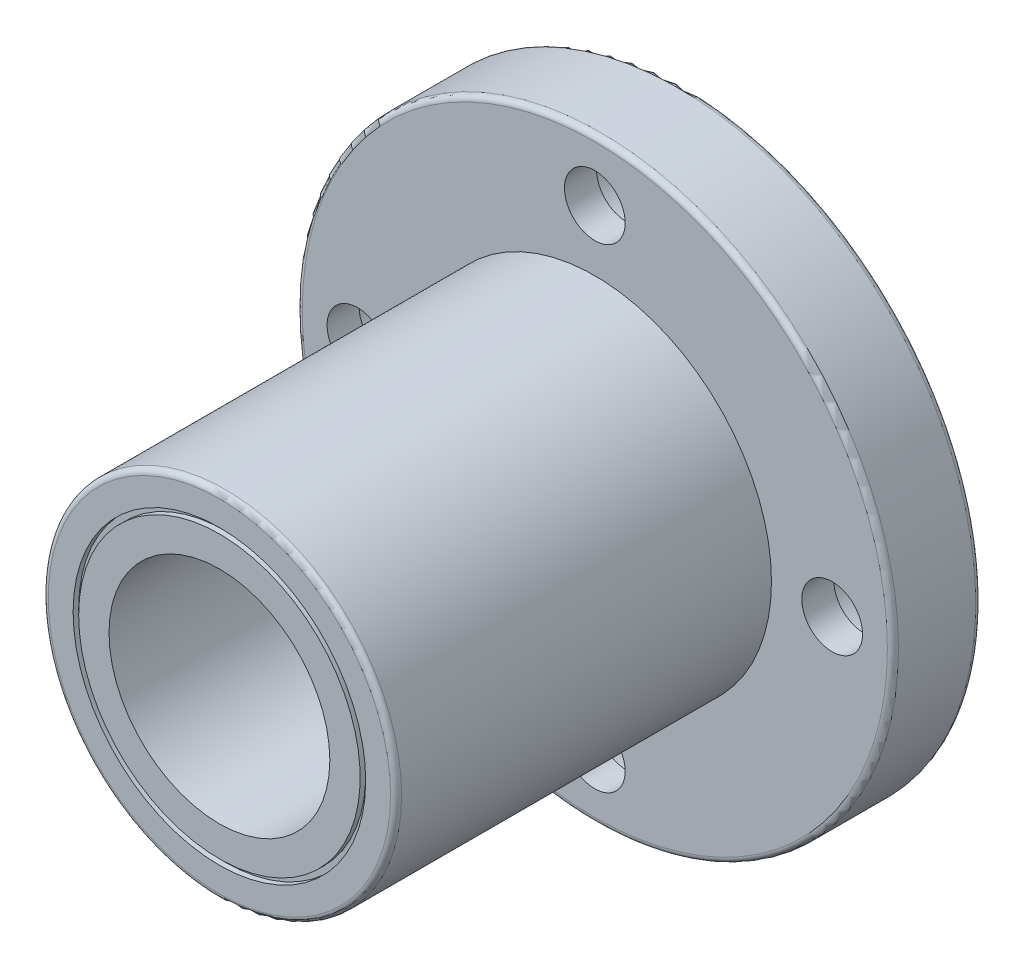
ISO-10303-21;
HEADER;
FILE_DESCRIPTION(('STEP AP214'),'2;1');
FILE_NAME('part.step','',(''),(''),'','','');
FILE_SCHEMA(('AUTOMOTIVE_DESIGN { 1 0 10303 214 1 1 1 1 }'));
ENDSEC;
DATA;
#1=APPLICATION_CONTEXT('core data for automotive mechanical design processes');
#2=APPLICATION_PROTOCOL_DEFINITION('international standard','automotive_design',2000,#1);
#3=PRODUCT_CONTEXT('',#1,'mechanical');
#4=PRODUCT('Part','Part','',(#3));
#5=PRODUCT_RELATED_PRODUCT_CATEGORY('part','',(#4));
#6=PRODUCT_DEFINITION_FORMATION('','',#4);
#7=PRODUCT_DEFINITION_CONTEXT('part definition',#1,'design');
#8=PRODUCT_DEFINITION('design','',#6,#7);
#9=PRODUCT_DEFINITION_SHAPE('','',#8);
#10=(LENGTH_UNIT() NAMED_UNIT(*) SI_UNIT(.MILLI.,.METRE.));
#11=(NAMED_UNIT(*) PLANE_ANGLE_UNIT() SI_UNIT($,.RADIAN.));
#12=(NAMED_UNIT(*) SI_UNIT($,.STERADIAN.) SOLID_ANGLE_UNIT());
#13=UNCERTAINTY_MEASURE_WITH_UNIT(LENGTH_MEASURE(1.E-05),#10,'distance_accuracy_value','');
#14=(GEOMETRIC_REPRESENTATION_CONTEXT(3) GLOBAL_UNCERTAINTY_ASSIGNED_CONTEXT((#13)) GLOBAL_UNIT_ASSIGNED_CONTEXT((#10,
#11,#12)) REPRESENTATION_CONTEXT('',''));
#15=CARTESIAN_POINT('',(0.,0.,0.));
#16=DIRECTION('',(0.,0.,1.));
#17=DIRECTION('',(1.,0.,0.));
#18=AXIS2_PLACEMENT_3D('',#15,#16,#17);
#19=CARTESIAN_POINT('',(0.,16.,0.));
#20=DIRECTION('',(0.,0.,-1.));
#21=DIRECTION('',(-1.,0.,0.));
#22=AXIS2_PLACEMENT_3D('',#19,#20,#21);
#23=PLANE('',#22);
#24=CARTESIAN_POINT('',(0.,0.,0.));
#25=DIRECTION('',(0.,0.,-1.));
#26=DIRECTION('',(-1.,0.,0.));
#27=AXIS2_PLACEMENT_3D('',#24,#25,#26);
#28=CIRCLE('',#27,26.5);
#29=CARTESIAN_POINT('',(-26.5,0.,0.));
#30=VERTEX_POINT('',#29);
#31=EDGE_CURVE('E71',#30,#30,#28,.T.);
#32=ORIENTED_EDGE('',*,*,#31,.T.);
#33=EDGE_LOOP('',(#32));
#34=FACE_BOUND('',#33,.T.);
#35=CARTESIAN_POINT('',(0.,-21.5,0.));
#36=DIRECTION('',(0.,0.,1.));
#37=DIRECTION('',(-1.,0.,0.));
#38=AXIS2_PLACEMENT_3D('',#35,#36,#37);
#39=CIRCLE('',#38,4.5);
#40=CARTESIAN_POINT('',(-4.5,-21.5,0.));
#41=VERTEX_POINT('',#40);
#42=EDGE_CURVE('E164',#41,#41,#39,.T.);
#43=ORIENTED_EDGE('',*,*,#42,.T.);
#44=EDGE_LOOP('',(#43));
#45=FACE_BOUND('',#44,.T.);
#46=CARTESIAN_POINT('',(0.,21.5,0.));
#47=DIRECTION('',(0.,0.,1.));
#48=DIRECTION('',(1.,0.,0.));
#49=AXIS2_PLACEMENT_3D('',#46,#47,#48);
#50=CIRCLE('',#49,4.5);
#51=CARTESIAN_POINT('',(4.5,21.5,0.));
#52=VERTEX_POINT('',#51);
#53=EDGE_CURVE('E132',#52,#52,#50,.T.);
#54=ORIENTED_EDGE('',*,*,#53,.T.);
#55=EDGE_LOOP('',(#54));
#56=FACE_BOUND('',#55,.T.);
#57=CARTESIAN_POINT('',(0.,0.,0.));
#58=DIRECTION('',(0.,0.,-1.));
#59=DIRECTION('',(-1.,0.,0.));
#60=AXIS2_PLACEMENT_3D('',#57,#58,#59);
#61=CIRCLE('',#60,16.);
#62=CARTESIAN_POINT('',(-16.,0.,0.));
#63=VERTEX_POINT('',#62);
#64=EDGE_CURVE('E128',#63,#63,#61,.T.);
#65=ORIENTED_EDGE('',*,*,#64,.F.);
#66=EDGE_LOOP('',(#65));
#67=FACE_BOUND('',#66,.T.);
#68=CARTESIAN_POINT('',(21.5,0.,0.));
#69=DIRECTION('',(0.,0.,1.));
#70=DIRECTION('',(0.,-1.,0.));
#71=AXIS2_PLACEMENT_3D('',#68,#69,#70);
#72=CIRCLE('',#71,4.5);
#73=CARTESIAN_POINT('',(21.5,-4.50000000000008,0.));
#74=VERTEX_POINT('',#73);
#75=EDGE_CURVE('E148',#74,#74,#72,.T.);
#76=ORIENTED_EDGE('',*,*,#75,.T.);
#77=EDGE_LOOP('',(#76));
#78=FACE_BOUND('',#77,.T.);
#79=CARTESIAN_POINT('',(-21.5,2.25200546355382E-13,0.));
#80=DIRECTION('',(0.,0.,1.));
#81=DIRECTION('',(0.,1.,0.));
#82=AXIS2_PLACEMENT_3D('',#79,#80,#81);
#83=CIRCLE('',#82,4.5);
#84=CARTESIAN_POINT('',(-21.5,4.50000000000023,0.));
#85=VERTEX_POINT('',#84);
#86=EDGE_CURVE('E180',#85,#85,#83,.T.);
#87=ORIENTED_EDGE('',*,*,#86,.T.);
#88=EDGE_LOOP('',(#87));
#89=FACE_BOUND('',#88,.T.);
#90=ADVANCED_FACE('F40',(#34,#45,#56,#67,#78,#89),#23,.T.);
#91=CARTESIAN_POINT('',(0.,27.,8.));
#92=DIRECTION('',(0.,0.,1.));
#93=DIRECTION('',(1.,0.,0.));
#94=AXIS2_PLACEMENT_3D('',#91,#92,#93);
#95=PLANE('',#94);
#96=CARTESIAN_POINT('',(0.,0.,8.));
#97=DIRECTION('',(0.,0.,1.));
#98=DIRECTION('',(1.,0.,0.));
#99=AXIS2_PLACEMENT_3D('',#96,#97,#98);
#100=CIRCLE('',#99,26.5);
#101=CARTESIAN_POINT('',(26.5,0.,8.));
#102=VERTEX_POINT('',#101);
#103=EDGE_CURVE('E55',#102,#102,#100,.T.);
#104=ORIENTED_EDGE('',*,*,#103,.T.);
#105=EDGE_LOOP('',(#104));
#106=FACE_BOUND('',#105,.T.);
#107=CARTESIAN_POINT('',(0.,-21.5,8.));
#108=DIRECTION('',(0.,0.,1.));
#109=DIRECTION('',(-1.,0.,0.));
#110=AXIS2_PLACEMENT_3D('',#107,#108,#109);
#111=CIRCLE('',#110,2.75);
#112=CARTESIAN_POINT('',(-2.75,-21.5,8.));
#113=VERTEX_POINT('',#112);
#114=EDGE_CURVE('E176',#113,#113,#111,.T.);
#115=ORIENTED_EDGE('',*,*,#114,.F.);
#116=EDGE_LOOP('',(#115));
#117=FACE_BOUND('',#116,.T.);
#118=CARTESIAN_POINT('',(0.,21.5,8.));
#119=DIRECTION('',(0.,0.,1.));
#120=DIRECTION('',(1.,0.,0.));
#121=AXIS2_PLACEMENT_3D('',#118,#119,#120);
#122=CIRCLE('',#121,2.75);
#123=CARTESIAN_POINT('',(2.75,21.5,8.));
#124=VERTEX_POINT('',#123);
#125=EDGE_CURVE('E144',#124,#124,#122,.T.);
#126=ORIENTED_EDGE('',*,*,#125,.F.);
#127=EDGE_LOOP('',(#126));
#128=FACE_BOUND('',#127,.T.);
#129=CARTESIAN_POINT('',(0.,0.,8.));
#130=DIRECTION('',(0.,0.,-1.));
#131=DIRECTION('',(-1.,0.,0.));
#132=AXIS2_PLACEMENT_3D('',#129,#130,#131);
#133=CIRCLE('',#132,16.);
#134=CARTESIAN_POINT('',(-16.,0.,8.));
#135=VERTEX_POINT('',#134);
#136=EDGE_CURVE('E74',#135,#135,#133,.T.);
#137=ORIENTED_EDGE('',*,*,#136,.T.);
#138=EDGE_LOOP('',(#137));
#139=FACE_BOUND('',#138,.T.);
#140=CARTESIAN_POINT('',(21.5,0.,8.));
#141=DIRECTION('',(0.,0.,1.));
#142=DIRECTION('',(0.,-1.,0.));
#143=AXIS2_PLACEMENT_3D('',#140,#141,#142);
#144=CIRCLE('',#143,2.75);
#145=CARTESIAN_POINT('',(21.5,-2.75000000000007,8.));
#146=VERTEX_POINT('',#145);
#147=EDGE_CURVE('E160',#146,#146,#144,.T.);
#148=ORIENTED_EDGE('',*,*,#147,.F.);
#149=EDGE_LOOP('',(#148));
#150=FACE_BOUND('',#149,.T.);
#151=CARTESIAN_POINT('',(-21.5,2.25200546355382E-13,8.));
#152=DIRECTION('',(0.,0.,1.));
#153=DIRECTION('',(0.,1.,0.));
#154=AXIS2_PLACEMENT_3D('',#151,#152,#153);
#155=CIRCLE('',#154,2.75);
#156=CARTESIAN_POINT('',(-21.5,2.75000000000022,8.));
#157=VERTEX_POINT('',#156);
#158=EDGE_CURVE('E192',#157,#157,#155,.T.);
#159=ORIENTED_EDGE('',*,*,#158,.F.);
#160=EDGE_LOOP('',(#159));
#161=FACE_BOUND('',#160,.T.);
#162=ADVANCED_FACE('F200',(#106,#117,#128,#139,#150,#161),#95,.T.);
#163=CARTESIAN_POINT('',(0.,0.,0.));
#164=DIRECTION('',(0.,0.,-1.));
#165=DIRECTION('',(-1.,0.,0.));
#166=AXIS2_PLACEMENT_3D('',#163,#164,#165);
#167=CYLINDRICAL_SURFACE('',#166,27.);
#168=CARTESIAN_POINT('',(0.,0.,0.500000000000001));
#169=DIRECTION('',(0.,0.,-1.));
#170=DIRECTION('',(-1.,0.,0.));
#171=AXIS2_PLACEMENT_3D('',#168,#169,#170);
#172=CIRCLE('',#171,27.);
#173=CARTESIAN_POINT('',(-27.,0.,0.500000000000001));
#174=VERTEX_POINT('',#173);
#175=EDGE_CURVE('E62',#174,#174,#172,.F.);
#176=ORIENTED_EDGE('',*,*,#175,.T.);
#177=EDGE_LOOP('',(#176));
#178=FACE_BOUND('',#177,.T.);
#179=CARTESIAN_POINT('',(0.,0.,7.5));
#180=DIRECTION('',(0.,0.,1.));
#181=DIRECTION('',(1.,0.,0.));
#182=AXIS2_PLACEMENT_3D('',#179,#180,#181);
#183=CIRCLE('',#182,27.);
#184=CARTESIAN_POINT('',(27.,0.,7.5));
#185=VERTEX_POINT('',#184);
#186=EDGE_CURVE('E68',#185,#185,#183,.F.);
#187=ORIENTED_EDGE('',*,*,#186,.T.);
#188=EDGE_LOOP('',(#187));
#189=FACE_BOUND('',#188,.T.);
#190=ADVANCED_FACE('F202',(#178,#189),#167,.T.);
#191=CARTESIAN_POINT('',(0.,0.,0.));
#192=DIRECTION('',(0.,0.,-1.));
#193=DIRECTION('',(-1.,0.,0.));
#194=AXIS2_PLACEMENT_3D('',#191,#192,#193);
#195=CYLINDRICAL_SURFACE('',#194,16.);
#196=CARTESIAN_POINT('',(0.,0.,41.5));
#197=DIRECTION('',(0.,0.,1.));
#198=DIRECTION('',(1.,0.,0.));
#199=AXIS2_PLACEMENT_3D('',#196,#197,#198);
#200=CIRCLE('',#199,16.);
#201=CARTESIAN_POINT('',(16.,0.,41.5));
#202=VERTEX_POINT('',#201);
#203=EDGE_CURVE('E48',#202,#202,#200,.F.);
#204=ORIENTED_EDGE('',*,*,#203,.T.);
#205=EDGE_LOOP('',(#204));
#206=FACE_BOUND('',#205,.T.);
#207=ORIENTED_EDGE('',*,*,#136,.F.);
#208=EDGE_LOOP('',(#207));
#209=FACE_BOUND('',#208,.T.);
#210=ADVANCED_FACE('F209',(#206,#209),#195,.T.);
#211=CARTESIAN_POINT('',(0.,16.,42.));
#212=DIRECTION('',(0.,0.,1.));
#213=DIRECTION('',(1.,0.,0.));
#214=AXIS2_PLACEMENT_3D('',#211,#212,#213);
#215=PLANE('',#214);
#216=CARTESIAN_POINT('',(0.,0.,42.));
#217=DIRECTION('',(0.,0.,1.));
#218=DIRECTION('',(1.,0.,0.));
#219=AXIS2_PLACEMENT_3D('',#216,#217,#218);
#220=CIRCLE('',#219,15.5);
#221=CARTESIAN_POINT('',(15.5,0.,42.));
#222=VERTEX_POINT('',#221);
#223=EDGE_CURVE('E10',#222,#222,#220,.T.);
#224=ORIENTED_EDGE('',*,*,#223,.T.);
#225=EDGE_LOOP('',(#224));
#226=FACE_BOUND('',#225,.T.);
#227=CARTESIAN_POINT('',(0.,0.,42.));
#228=DIRECTION('',(0.,0.,-1.));
#229=DIRECTION('',(-1.,0.,0.));
#230=AXIS2_PLACEMENT_3D('',#227,#228,#229);
#231=CIRCLE('',#230,13.25);
#232=CARTESIAN_POINT('',(-13.25,0.,42.));
#233=VERTEX_POINT('',#232);
#234=EDGE_CURVE('E78',#233,#233,#231,.T.);
#235=ORIENTED_EDGE('',*,*,#234,.T.);
#236=EDGE_LOOP('',(#235));
#237=FACE_BOUND('',#236,.T.);
#238=ADVANCED_FACE('F466',(#226,#237),#215,.T.);
#239=CARTESIAN_POINT('',(0.,0.,0.));
#240=DIRECTION('',(0.,0.,-1.));
#241=DIRECTION('',(-1.,0.,0.));
#242=AXIS2_PLACEMENT_3D('',#239,#240,#241);
#243=CYLINDRICAL_SURFACE('',#242,13.25);
#244=CARTESIAN_POINT('',(0.,0.,41.5));
#245=DIRECTION('',(0.,0.,-1.));
#246=DIRECTION('',(-1.,0.,0.));
#247=AXIS2_PLACEMENT_3D('',#244,#245,#246);
#248=CIRCLE('',#247,13.25);
#249=CARTESIAN_POINT('',(-13.25,0.,41.5));
#250=VERTEX_POINT('',#249);
#251=EDGE_CURVE('E82',#250,#250,#248,.T.);
#252=ORIENTED_EDGE('',*,*,#251,.T.);
#253=EDGE_LOOP('',(#252));
#254=FACE_BOUND('',#253,.T.);
#255=ORIENTED_EDGE('',*,*,#234,.F.);
#256=EDGE_LOOP('',(#255));
#257=FACE_BOUND('',#256,.T.);
#258=ADVANCED_FACE('F457',(#254,#257),#243,.F.);
#259=CARTESIAN_POINT('',(0.,13.25,41.5));
#260=DIRECTION('',(0.,0.,1.));
#261=DIRECTION('',(1.,0.,0.));
#262=AXIS2_PLACEMENT_3D('',#259,#260,#261);
#263=PLANE('',#262);
#264=CARTESIAN_POINT('',(0.,0.,41.5));
#265=DIRECTION('',(0.,0.,-1.));
#266=DIRECTION('',(-1.,0.,0.));
#267=AXIS2_PLACEMENT_3D('',#264,#265,#266);
#268=CIRCLE('',#267,12.75);
#269=CARTESIAN_POINT('',(-12.75,0.,41.5));
#270=VERTEX_POINT('',#269);
#271=EDGE_CURVE('E86',#270,#270,#268,.T.);
#272=ORIENTED_EDGE('',*,*,#271,.T.);
#273=EDGE_LOOP('',(#272));
#274=FACE_BOUND('',#273,.T.);
#275=ORIENTED_EDGE('',*,*,#251,.F.);
#276=EDGE_LOOP('',(#275));
#277=FACE_BOUND('',#276,.T.);
#278=ADVANCED_FACE('F448',(#274,#277),#263,.T.);
#279=CARTESIAN_POINT('',(0.,0.,0.));
#280=DIRECTION('',(0.,0.,-1.));
#281=DIRECTION('',(-1.,0.,0.));
#282=AXIS2_PLACEMENT_3D('',#279,#280,#281);
#283=CYLINDRICAL_SURFACE('',#282,12.75);
#284=CARTESIAN_POINT('',(0.,0.,42.));
#285=DIRECTION('',(0.,0.,-1.));
#286=DIRECTION('',(-1.,0.,0.));
#287=AXIS2_PLACEMENT_3D('',#284,#285,#286);
#288=CIRCLE('',#287,12.75);
#289=CARTESIAN_POINT('',(-12.75,0.,42.));
#290=VERTEX_POINT('',#289);
#291=EDGE_CURVE('E90',#290,#290,#288,.T.);
#292=ORIENTED_EDGE('',*,*,#291,.T.);
#293=EDGE_LOOP('',(#292));
#294=FACE_BOUND('',#293,.T.);
#295=ORIENTED_EDGE('',*,*,#271,.F.);
#296=EDGE_LOOP('',(#295));
#297=FACE_BOUND('',#296,.T.);
#298=ADVANCED_FACE('F440',(#294,#297),#283,.T.);
#299=CARTESIAN_POINT('',(0.,12.75,42.));
#300=DIRECTION('',(0.,0.,1.));
#301=DIRECTION('',(1.,0.,0.));
#302=AXIS2_PLACEMENT_3D('',#299,#300,#301);
#303=PLANE('',#302);
#304=CARTESIAN_POINT('',(0.,0.,42.));
#305=DIRECTION('',(0.,0.,-1.));
#306=DIRECTION('',(-1.,0.,0.));
#307=AXIS2_PLACEMENT_3D('',#304,#305,#306);
#308=CIRCLE('',#307,10.);
#309=CARTESIAN_POINT('',(-10.,0.,42.));
#310=VERTEX_POINT('',#309);
#311=EDGE_CURVE('E94',#310,#310,#308,.T.);
#312=ORIENTED_EDGE('',*,*,#311,.T.);
#313=EDGE_LOOP('',(#312));
#314=FACE_BOUND('',#313,.T.);
#315=ORIENTED_EDGE('',*,*,#291,.F.);
#316=EDGE_LOOP('',(#315));
#317=FACE_BOUND('',#316,.T.);
#318=ADVANCED_FACE('F432',(#314,#317),#303,.T.);
#319=CARTESIAN_POINT('',(0.,0.,0.));
#320=DIRECTION('',(0.,0.,-1.));
#321=DIRECTION('',(-1.,0.,0.));
#322=AXIS2_PLACEMENT_3D('',#319,#320,#321);
#323=CYLINDRICAL_SURFACE('',#322,10.);
#324=CARTESIAN_POINT('',(0.,0.,0.));
#325=DIRECTION('',(0.,0.,-1.));
#326=DIRECTION('',(-1.,0.,0.));
#327=AXIS2_PLACEMENT_3D('',#324,#325,#326);
#328=CIRCLE('',#327,10.);
#329=CARTESIAN_POINT('',(-10.,0.,0.));
#330=VERTEX_POINT('',#329);
#331=EDGE_CURVE('E98',#330,#330,#328,.T.);
#332=ORIENTED_EDGE('',*,*,#331,.T.);
#333=EDGE_LOOP('',(#332));
#334=FACE_BOUND('',#333,.T.);
#335=ORIENTED_EDGE('',*,*,#311,.F.);
#336=EDGE_LOOP('',(#335));
#337=FACE_BOUND('',#336,.T.);
#338=ADVANCED_FACE('F423',(#334,#337),#323,.F.);
#339=CARTESIAN_POINT('',(0.,10.,0.));
#340=DIRECTION('',(0.,0.,-1.));
#341=DIRECTION('',(-1.,0.,0.));
#342=AXIS2_PLACEMENT_3D('',#339,#340,#341);
#343=PLANE('',#342);
#344=CARTESIAN_POINT('',(0.,0.,0.));
#345=DIRECTION('',(0.,0.,-1.));
#346=DIRECTION('',(-1.,0.,0.));
#347=AXIS2_PLACEMENT_3D('',#344,#345,#346);
#348=CIRCLE('',#347,12.75);
#349=CARTESIAN_POINT('',(-12.75,0.,0.));
#350=VERTEX_POINT('',#349);
#351=EDGE_CURVE('E102',#350,#350,#348,.T.);
#352=ORIENTED_EDGE('',*,*,#351,.T.);
#353=EDGE_LOOP('',(#352));
#354=FACE_BOUND('',#353,.T.);
#355=ORIENTED_EDGE('',*,*,#331,.F.);
#356=EDGE_LOOP('',(#355));
#357=FACE_BOUND('',#356,.T.);
#358=ADVANCED_FACE('F414',(#354,#357),#343,.T.);
#359=CARTESIAN_POINT('',(0.,0.,0.));
#360=DIRECTION('',(0.,0.,-1.));
#361=DIRECTION('',(-1.,0.,0.));
#362=AXIS2_PLACEMENT_3D('',#359,#360,#361);
#363=CYLINDRICAL_SURFACE('',#362,12.75);
#364=CARTESIAN_POINT('',(0.,0.,0.5));
#365=DIRECTION('',(0.,0.,-1.));
#366=DIRECTION('',(-1.,0.,0.));
#367=AXIS2_PLACEMENT_3D('',#364,#365,#366);
#368=CIRCLE('',#367,12.75);
#369=CARTESIAN_POINT('',(-12.75,0.,0.5));
#370=VERTEX_POINT('',#369);
#371=EDGE_CURVE('E106',#370,#370,#368,.T.);
#372=ORIENTED_EDGE('',*,*,#371,.T.);
#373=EDGE_LOOP('',(#372));
#374=FACE_BOUND('',#373,.T.);
#375=ORIENTED_EDGE('',*,*,#351,.F.);
#376=EDGE_LOOP('',(#375));
#377=FACE_BOUND('',#376,.T.);
#378=ADVANCED_FACE('F405',(#374,#377),#363,.T.);
#379=CARTESIAN_POINT('',(0.,13.25,0.5));
#380=DIRECTION('',(0.,0.,-1.));
#381=DIRECTION('',(-1.,0.,0.));
#382=AXIS2_PLACEMENT_3D('',#379,#380,#381);
#383=PLANE('',#382);
#384=CARTESIAN_POINT('',(0.,0.,0.5));
#385=DIRECTION('',(0.,0.,-1.));
#386=DIRECTION('',(-1.,0.,0.));
#387=AXIS2_PLACEMENT_3D('',#384,#385,#386);
#388=CIRCLE('',#387,13.25);
#389=CARTESIAN_POINT('',(-13.25,0.,0.5));
#390=VERTEX_POINT('',#389);
#391=EDGE_CURVE('E110',#390,#390,#388,.T.);
#392=ORIENTED_EDGE('',*,*,#391,.T.);
#393=EDGE_LOOP('',(#392));
#394=FACE_BOUND('',#393,.T.);
#395=ORIENTED_EDGE('',*,*,#371,.F.);
#396=EDGE_LOOP('',(#395));
#397=FACE_BOUND('',#396,.T.);
#398=ADVANCED_FACE('F396',(#394,#397),#383,.T.);
#399=CARTESIAN_POINT('',(0.,0.,0.));
#400=DIRECTION('',(0.,0.,-1.));
#401=DIRECTION('',(-1.,0.,0.));
#402=AXIS2_PLACEMENT_3D('',#399,#400,#401);
#403=CYLINDRICAL_SURFACE('',#402,13.25);
#404=CARTESIAN_POINT('',(0.,0.,0.));
#405=DIRECTION('',(0.,0.,-1.));
#406=DIRECTION('',(-1.,0.,0.));
#407=AXIS2_PLACEMENT_3D('',#404,#405,#406);
#408=CIRCLE('',#407,13.25);
#409=CARTESIAN_POINT('',(-13.25,0.,0.));
#410=VERTEX_POINT('',#409);
#411=EDGE_CURVE('E114',#410,#410,#408,.T.);
#412=ORIENTED_EDGE('',*,*,#411,.T.);
#413=EDGE_LOOP('',(#412));
#414=FACE_BOUND('',#413,.T.);
#415=ORIENTED_EDGE('',*,*,#391,.F.);
#416=EDGE_LOOP('',(#415));
#417=FACE_BOUND('',#416,.T.);
#418=ADVANCED_FACE('F387',(#414,#417),#403,.F.);
#419=CARTESIAN_POINT('',(0.,13.25,0.));
#420=DIRECTION('',(0.,0.,-1.));
#421=DIRECTION('',(-1.,0.,0.));
#422=AXIS2_PLACEMENT_3D('',#419,#420,#421);
#423=PLANE('',#422);
#424=CARTESIAN_POINT('',(0.,0.,0.));
#425=DIRECTION('',(0.,0.,-1.));
#426=DIRECTION('',(-1.,0.,0.));
#427=AXIS2_PLACEMENT_3D('',#424,#425,#426);
#428=CIRCLE('',#427,15.5);
#429=CARTESIAN_POINT('',(-15.5,0.,0.));
#430=VERTEX_POINT('',#429);
#431=EDGE_CURVE('E118',#430,#430,#428,.T.);
#432=ORIENTED_EDGE('',*,*,#431,.T.);
#433=EDGE_LOOP('',(#432));
#434=FACE_BOUND('',#433,.T.);
#435=ORIENTED_EDGE('',*,*,#411,.F.);
#436=EDGE_LOOP('',(#435));
#437=FACE_BOUND('',#436,.T.);
#438=ADVANCED_FACE('F378',(#434,#437),#423,.T.);
#439=CARTESIAN_POINT('',(0.,0.,0.));
#440=DIRECTION('',(0.,0.,-1.));
#441=DIRECTION('',(-1.,0.,0.));
#442=AXIS2_PLACEMENT_3D('',#439,#440,#441);
#443=CYLINDRICAL_SURFACE('',#442,15.5);
#444=CARTESIAN_POINT('',(0.,0.,0.499999999999999));
#445=DIRECTION('',(0.,0.,-1.));
#446=DIRECTION('',(-1.,0.,0.));
#447=AXIS2_PLACEMENT_3D('',#444,#445,#446);
#448=CIRCLE('',#447,15.5);
#449=CARTESIAN_POINT('',(-15.5,0.,0.499999999999999));
#450=VERTEX_POINT('',#449);
#451=EDGE_CURVE('E121',#450,#450,#448,.T.);
#452=ORIENTED_EDGE('',*,*,#451,.T.);
#453=EDGE_LOOP('',(#452));
#454=FACE_BOUND('',#453,.T.);
#455=ORIENTED_EDGE('',*,*,#431,.F.);
#456=EDGE_LOOP('',(#455));
#457=FACE_BOUND('',#456,.T.);
#458=ADVANCED_FACE('F369',(#454,#457),#443,.T.);
#459=CARTESIAN_POINT('',(0.,16.,0.5));
#460=DIRECTION('',(0.,0.,-1.));
#461=DIRECTION('',(-1.,0.,0.));
#462=AXIS2_PLACEMENT_3D('',#459,#460,#461);
#463=PLANE('',#462);
#464=CARTESIAN_POINT('',(0.,0.,0.5));
#465=DIRECTION('',(0.,0.,-1.));
#466=DIRECTION('',(-1.,0.,0.));
#467=AXIS2_PLACEMENT_3D('',#464,#465,#466);
#468=CIRCLE('',#467,16.);
#469=CARTESIAN_POINT('',(-16.,0.,0.5));
#470=VERTEX_POINT('',#469);
#471=EDGE_CURVE('E125',#470,#470,#468,.T.);
#472=ORIENTED_EDGE('',*,*,#471,.T.);
#473=EDGE_LOOP('',(#472));
#474=FACE_BOUND('',#473,.T.);
#475=ORIENTED_EDGE('',*,*,#451,.F.);
#476=EDGE_LOOP('',(#475));
#477=FACE_BOUND('',#476,.T.);
#478=ADVANCED_FACE('F360',(#474,#477),#463,.T.);
#479=CARTESIAN_POINT('',(0.,0.,0.));
#480=DIRECTION('',(0.,0.,-1.));
#481=DIRECTION('',(-1.,0.,0.));
#482=AXIS2_PLACEMENT_3D('',#479,#480,#481);
#483=CYLINDRICAL_SURFACE('',#482,16.);
#484=ORIENTED_EDGE('',*,*,#64,.T.);
#485=EDGE_LOOP('',(#484));
#486=FACE_BOUND('',#485,.T.);
#487=ORIENTED_EDGE('',*,*,#471,.F.);
#488=EDGE_LOOP('',(#487));
#489=FACE_BOUND('',#488,.T.);
#490=ADVANCED_FACE('F351',(#486,#489),#483,.F.);
#491=CARTESIAN_POINT('',(0.,21.5,0.));
#492=DIRECTION('',(0.,0.,1.));
#493=DIRECTION('',(1.,0.,0.));
#494=AXIS2_PLACEMENT_3D('',#491,#492,#493);
#495=CYLINDRICAL_SURFACE('',#494,4.5);
#496=CARTESIAN_POINT('',(0.,21.5,5.1));
#497=DIRECTION('',(0.,0.,1.));
#498=DIRECTION('',(1.,0.,0.));
#499=AXIS2_PLACEMENT_3D('',#496,#497,#498);
#500=CIRCLE('',#499,4.5);
#501=CARTESIAN_POINT('',(4.5,21.5,5.1));
#502=VERTEX_POINT('',#501);
#503=EDGE_CURVE('E136',#502,#502,#500,.T.);
#504=ORIENTED_EDGE('',*,*,#503,.T.);
#505=EDGE_LOOP('',(#504));
#506=FACE_BOUND('',#505,.T.);
#507=ORIENTED_EDGE('',*,*,#53,.F.);
#508=EDGE_LOOP('',(#507));
#509=FACE_BOUND('',#508,.T.);
#510=ADVANCED_FACE('F342',(#506,#509),#495,.F.);
#511=CARTESIAN_POINT('',(0.,26.,5.1));
#512=DIRECTION('',(0.,0.,-1.));
#513=DIRECTION('',(-1.,0.,0.));
#514=AXIS2_PLACEMENT_3D('',#511,#512,#513);
#515=PLANE('',#514);
#516=CARTESIAN_POINT('',(0.,21.5,5.1));
#517=DIRECTION('',(0.,0.,1.));
#518=DIRECTION('',(1.,0.,0.));
#519=AXIS2_PLACEMENT_3D('',#516,#517,#518);
#520=CIRCLE('',#519,2.75);
#521=CARTESIAN_POINT('',(2.75,21.5,5.1));
#522=VERTEX_POINT('',#521);
#523=EDGE_CURVE('E140',#522,#522,#520,.T.);
#524=ORIENTED_EDGE('',*,*,#523,.T.);
#525=EDGE_LOOP('',(#524));
#526=FACE_BOUND('',#525,.T.);
#527=ORIENTED_EDGE('',*,*,#503,.F.);
#528=EDGE_LOOP('',(#527));
#529=FACE_BOUND('',#528,.T.);
#530=ADVANCED_FACE('F333',(#526,#529),#515,.T.);
#531=CARTESIAN_POINT('',(0.,21.5,0.));
#532=DIRECTION('',(0.,0.,1.));
#533=DIRECTION('',(1.,0.,0.));
#534=AXIS2_PLACEMENT_3D('',#531,#532,#533);
#535=CYLINDRICAL_SURFACE('',#534,2.75);
#536=ORIENTED_EDGE('',*,*,#125,.T.);
#537=EDGE_LOOP('',(#536));
#538=FACE_BOUND('',#537,.T.);
#539=ORIENTED_EDGE('',*,*,#523,.F.);
#540=EDGE_LOOP('',(#539));
#541=FACE_BOUND('',#540,.T.);
#542=ADVANCED_FACE('F324',(#538,#541),#535,.F.);
#543=CARTESIAN_POINT('',(21.5,0.,0.));
#544=DIRECTION('',(0.,0.,1.));
#545=DIRECTION('',(0.,-1.,0.));
#546=AXIS2_PLACEMENT_3D('',#543,#544,#545);
#547=CYLINDRICAL_SURFACE('',#546,4.5);
#548=CARTESIAN_POINT('',(21.5,0.,5.1));
#549=DIRECTION('',(0.,0.,1.));
#550=DIRECTION('',(0.,-1.,0.));
#551=AXIS2_PLACEMENT_3D('',#548,#549,#550);
#552=CIRCLE('',#551,4.5);
#553=CARTESIAN_POINT('',(21.5,-4.50000000000008,5.1));
#554=VERTEX_POINT('',#553);
#555=EDGE_CURVE('E152',#554,#554,#552,.T.);
#556=ORIENTED_EDGE('',*,*,#555,.T.);
#557=EDGE_LOOP('',(#556));
#558=FACE_BOUND('',#557,.T.);
#559=ORIENTED_EDGE('',*,*,#75,.F.);
#560=EDGE_LOOP('',(#559));
#561=FACE_BOUND('',#560,.T.);
#562=ADVANCED_FACE('F316',(#558,#561),#547,.F.);
#563=CARTESIAN_POINT('',(26.,0.,5.1));
#564=DIRECTION('',(0.,0.,-1.));
#565=DIRECTION('',(0.,1.,0.));
#566=AXIS2_PLACEMENT_3D('',#563,#564,#565);
#567=PLANE('',#566);
#568=CARTESIAN_POINT('',(21.5,0.,5.1));
#569=DIRECTION('',(0.,0.,1.));
#570=DIRECTION('',(0.,-1.,0.));
#571=AXIS2_PLACEMENT_3D('',#568,#569,#570);
#572=CIRCLE('',#571,2.75);
#573=CARTESIAN_POINT('',(21.5,-2.75000000000007,5.1));
#574=VERTEX_POINT('',#573);
#575=EDGE_CURVE('E156',#574,#574,#572,.T.);
#576=ORIENTED_EDGE('',*,*,#575,.T.);
#577=EDGE_LOOP('',(#576));
#578=FACE_BOUND('',#577,.T.);
#579=ORIENTED_EDGE('',*,*,#555,.F.);
#580=EDGE_LOOP('',(#579));
#581=FACE_BOUND('',#580,.T.);
#582=ADVANCED_FACE('F308',(#578,#581),#567,.T.);
#583=CARTESIAN_POINT('',(21.5,0.,0.));
#584=DIRECTION('',(0.,0.,1.));
#585=DIRECTION('',(0.,-1.,0.));
#586=AXIS2_PLACEMENT_3D('',#583,#584,#585);
#587=CYLINDRICAL_SURFACE('',#586,2.75);
#588=ORIENTED_EDGE('',*,*,#147,.T.);
#589=EDGE_LOOP('',(#588));
#590=FACE_BOUND('',#589,.T.);
#591=ORIENTED_EDGE('',*,*,#575,.F.);
#592=EDGE_LOOP('',(#591));
#593=FACE_BOUND('',#592,.T.);
#594=ADVANCED_FACE('F300',(#590,#593),#587,.F.);
#595=CARTESIAN_POINT('',(0.,-21.5,0.));
#596=DIRECTION('',(0.,0.,1.));
#597=DIRECTION('',(-1.,0.,0.));
#598=AXIS2_PLACEMENT_3D('',#595,#596,#597);
#599=CYLINDRICAL_SURFACE('',#598,4.5);
#600=CARTESIAN_POINT('',(0.,-21.5,5.1));
#601=DIRECTION('',(0.,0.,1.));
#602=DIRECTION('',(-1.,0.,0.));
#603=AXIS2_PLACEMENT_3D('',#600,#601,#602);
#604=CIRCLE('',#603,4.5);
#605=CARTESIAN_POINT('',(-4.5,-21.5,5.1));
#606=VERTEX_POINT('',#605);
#607=EDGE_CURVE('E168',#606,#606,#604,.T.);
#608=ORIENTED_EDGE('',*,*,#607,.T.);
#609=EDGE_LOOP('',(#608));
#610=FACE_BOUND('',#609,.T.);
#611=ORIENTED_EDGE('',*,*,#42,.F.);
#612=EDGE_LOOP('',(#611));
#613=FACE_BOUND('',#612,.T.);
#614=ADVANCED_FACE('F292',(#610,#613),#599,.F.);
#615=CARTESIAN_POINT('',(0.,-26.,5.1));
#616=DIRECTION('',(0.,0.,-1.));
#617=DIRECTION('',(1.,0.,0.));
#618=AXIS2_PLACEMENT_3D('',#615,#616,#617);
#619=PLANE('',#618);
#620=CARTESIAN_POINT('',(0.,-21.5,5.1));
#621=DIRECTION('',(0.,0.,1.));
#622=DIRECTION('',(-1.,0.,0.));
#623=AXIS2_PLACEMENT_3D('',#620,#621,#622);
#624=CIRCLE('',#623,2.75);
#625=CARTESIAN_POINT('',(-2.75,-21.5,5.1));
#626=VERTEX_POINT('',#625);
#627=EDGE_CURVE('E172',#626,#626,#624,.T.);
#628=ORIENTED_EDGE('',*,*,#627,.T.);
#629=EDGE_LOOP('',(#628));
#630=FACE_BOUND('',#629,.T.);
#631=ORIENTED_EDGE('',*,*,#607,.F.);
#632=EDGE_LOOP('',(#631));
#633=FACE_BOUND('',#632,.T.);
#634=ADVANCED_FACE('F283',(#630,#633),#619,.T.);
#635=CARTESIAN_POINT('',(0.,-21.5,0.));
#636=DIRECTION('',(0.,0.,1.));
#637=DIRECTION('',(-1.,0.,0.));
#638=AXIS2_PLACEMENT_3D('',#635,#636,#637);
#639=CYLINDRICAL_SURFACE('',#638,2.75);
#640=ORIENTED_EDGE('',*,*,#114,.T.);
#641=EDGE_LOOP('',(#640));
#642=FACE_BOUND('',#641,.T.);
#643=ORIENTED_EDGE('',*,*,#627,.F.);
#644=EDGE_LOOP('',(#643));
#645=FACE_BOUND('',#644,.T.);
#646=ADVANCED_FACE('F272',(#642,#645),#639,.F.);
#647=CARTESIAN_POINT('',(-21.5,2.25200546355382E-13,0.));
#648=DIRECTION('',(0.,0.,1.));
#649=DIRECTION('',(0.,1.,0.));
#650=AXIS2_PLACEMENT_3D('',#647,#648,#649);
#651=CYLINDRICAL_SURFACE('',#650,4.5);
#652=CARTESIAN_POINT('',(-21.5,2.25200546355382E-13,5.1));
#653=DIRECTION('',(0.,0.,1.));
#654=DIRECTION('',(0.,1.,0.));
#655=AXIS2_PLACEMENT_3D('',#652,#653,#654);
#656=CIRCLE('',#655,4.5);
#657=CARTESIAN_POINT('',(-21.5,4.50000000000023,5.1));
#658=VERTEX_POINT('',#657);
#659=EDGE_CURVE('E184',#658,#658,#656,.T.);
#660=ORIENTED_EDGE('',*,*,#659,.T.);
#661=EDGE_LOOP('',(#660));
#662=FACE_BOUND('',#661,.T.);
#663=ORIENTED_EDGE('',*,*,#86,.F.);
#664=EDGE_LOOP('',(#663));
#665=FACE_BOUND('',#664,.T.);
#666=ADVANCED_FACE('F261',(#662,#665),#651,.F.);
#667=CARTESIAN_POINT('',(-26.,2.72335544429764E-13,5.1));
#668=DIRECTION('',(0.,0.,-1.));
#669=DIRECTION('',(0.,-1.,0.));
#670=AXIS2_PLACEMENT_3D('',#667,#668,#669);
#671=PLANE('',#670);
#672=CARTESIAN_POINT('',(-21.5,2.25200546355382E-13,5.1));
#673=DIRECTION('',(0.,0.,1.));
#674=DIRECTION('',(0.,1.,0.));
#675=AXIS2_PLACEMENT_3D('',#672,#673,#674);
#676=CIRCLE('',#675,2.75);
#677=CARTESIAN_POINT('',(-21.5,2.75000000000022,5.1));
#678=VERTEX_POINT('',#677);
#679=EDGE_CURVE('E188',#678,#678,#676,.T.);
#680=ORIENTED_EDGE('',*,*,#679,.T.);
#681=EDGE_LOOP('',(#680));
#682=FACE_BOUND('',#681,.T.);
#683=ORIENTED_EDGE('',*,*,#659,.F.);
#684=EDGE_LOOP('',(#683));
#685=FACE_BOUND('',#684,.T.);
#686=ADVANCED_FACE('F251',(#682,#685),#671,.T.);
#687=CARTESIAN_POINT('',(-21.5,2.25200546355382E-13,0.));
#688=DIRECTION('',(0.,0.,1.));
#689=DIRECTION('',(0.,1.,0.));
#690=AXIS2_PLACEMENT_3D('',#687,#688,#689);
#691=CYLINDRICAL_SURFACE('',#690,2.75);
#692=ORIENTED_EDGE('',*,*,#158,.T.);
#693=EDGE_LOOP('',(#692));
#694=FACE_BOUND('',#693,.T.);
#695=ORIENTED_EDGE('',*,*,#679,.F.);
#696=EDGE_LOOP('',(#695));
#697=FACE_BOUND('',#696,.T.);
#698=ADVANCED_FACE('F197',(#694,#697),#691,.F.);
#699=CARTESIAN_POINT('',(0.,0.,0.500000000000001));
#700=DIRECTION('',(0.,0.,-1.));
#701=DIRECTION('',(-1.,0.,0.));
#702=AXIS2_PLACEMENT_3D('',#699,#700,#701);
#703=TOROIDAL_SURFACE('',#702,26.5,0.5);
#704=ORIENTED_EDGE('',*,*,#175,.F.);
#705=EDGE_LOOP('',(#704));
#706=FACE_BOUND('',#705,.T.);
#707=ORIENTED_EDGE('',*,*,#31,.F.);
#708=EDGE_LOOP('',(#707));
#709=FACE_BOUND('',#708,.T.);
#710=ADVANCED_FACE('F218',(#706,#709),#703,.T.);
#711=CARTESIAN_POINT('',(0.,0.,7.5));
#712=DIRECTION('',(0.,0.,1.));
#713=DIRECTION('',(1.,0.,0.));
#714=AXIS2_PLACEMENT_3D('',#711,#712,#713);
#715=TOROIDAL_SURFACE('',#714,26.5,0.5);
#716=ORIENTED_EDGE('',*,*,#103,.F.);
#717=EDGE_LOOP('',(#716));
#718=FACE_BOUND('',#717,.T.);
#719=ORIENTED_EDGE('',*,*,#186,.F.);
#720=EDGE_LOOP('',(#719));
#721=FACE_BOUND('',#720,.T.);
#722=ADVANCED_FACE('F220',(#718,#721),#715,.T.);
#723=CARTESIAN_POINT('',(0.,0.,41.5));
#724=DIRECTION('',(0.,0.,1.));
#725=DIRECTION('',(1.,0.,0.));
#726=AXIS2_PLACEMENT_3D('',#723,#724,#725);
#727=TOROIDAL_SURFACE('',#726,15.5,0.5);
#728=ORIENTED_EDGE('',*,*,#223,.F.);
#729=EDGE_LOOP('',(#728));
#730=FACE_BOUND('',#729,.T.);
#731=ORIENTED_EDGE('',*,*,#203,.F.);
#732=EDGE_LOOP('',(#731));
#733=FACE_BOUND('',#732,.T.);
#734=ADVANCED_FACE('F42',(#730,#733),#727,.T.);
#735=CLOSED_SHELL('',(#90,#162,#190,#210,#238,#258,#278,#298,#318,#338,#358,#378,#398,#418,#438,
#458,#478,#490,#510,#530,#542,#562,#582,#594,#614,#634,#646,#666,#686,#698,#710,#722,#734));
#736=MANIFOLD_SOLID_BREP('B2',#735);
#737=ADVANCED_BREP_SHAPE_REPRESENTATION('',(#18,#736),#14);
#738=SHAPE_DEFINITION_REPRESENTATION(#9,#737);
ENDSEC;
END-ISO-10303-21;
